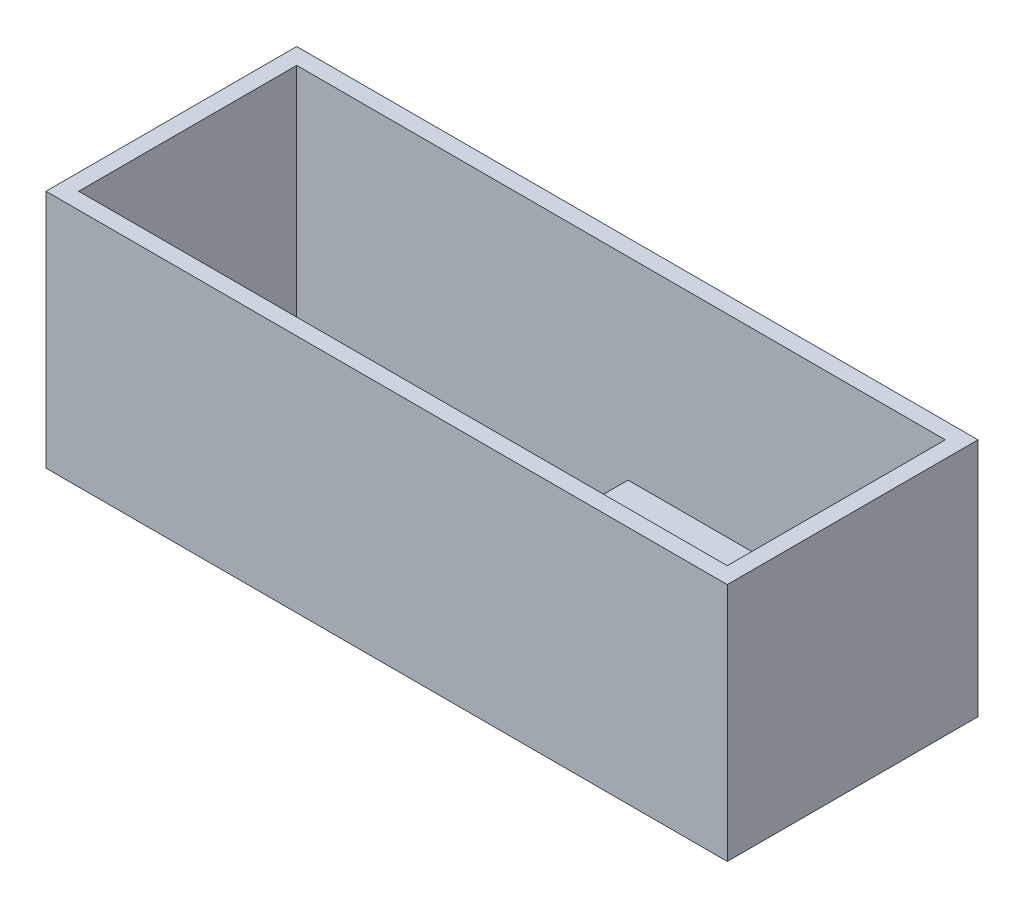
ISO-10303-21;
HEADER;
FILE_DESCRIPTION(('STEP AP214'),'2;1');
FILE_NAME('part.step','',(''),(''),'','','');
FILE_SCHEMA(('AUTOMOTIVE_DESIGN { 1 0 10303 214 1 1 1 1 }'));
ENDSEC;
DATA;
#1=APPLICATION_CONTEXT('core data for automotive mechanical design processes');
#2=APPLICATION_PROTOCOL_DEFINITION('international standard','automotive_design',2000,#1);
#3=PRODUCT_CONTEXT('',#1,'mechanical');
#4=PRODUCT('Part','Part','',(#3));
#5=PRODUCT_RELATED_PRODUCT_CATEGORY('part','',(#4));
#6=PRODUCT_DEFINITION_FORMATION('','',#4);
#7=PRODUCT_DEFINITION_CONTEXT('part definition',#1,'design');
#8=PRODUCT_DEFINITION('design','',#6,#7);
#9=PRODUCT_DEFINITION_SHAPE('','',#8);
#10=(LENGTH_UNIT() NAMED_UNIT(*) SI_UNIT(.MILLI.,.METRE.));
#11=(NAMED_UNIT(*) PLANE_ANGLE_UNIT() SI_UNIT($,.RADIAN.));
#12=(NAMED_UNIT(*) SI_UNIT($,.STERADIAN.) SOLID_ANGLE_UNIT());
#13=UNCERTAINTY_MEASURE_WITH_UNIT(LENGTH_MEASURE(1.E-05),#10,'distance_accuracy_value','');
#14=(GEOMETRIC_REPRESENTATION_CONTEXT(3) GLOBAL_UNCERTAINTY_ASSIGNED_CONTEXT((#13)) GLOBAL_UNIT_ASSIGNED_CONTEXT((#10,
#11,#12)) REPRESENTATION_CONTEXT('',''));
#15=CARTESIAN_POINT('',(0.,0.,0.));
#16=DIRECTION('',(0.,0.,1.));
#17=DIRECTION('',(1.,0.,0.));
#18=AXIS2_PLACEMENT_3D('',#15,#16,#17);
#19=CARTESIAN_POINT('',(59.5,44.,20.));
#20=DIRECTION('',(0.,0.,-1.));
#21=DIRECTION('',(-1.,0.,0.));
#22=AXIS2_PLACEMENT_3D('',#19,#20,#21);
#23=PLANE('',#22);
#24=DIRECTION('',(1.,0.,0.));
#25=VECTOR('',#24,1.);
#26=CARTESIAN_POINT('',(1.29999999999998,8.5,20.));
#27=LINE('',#26,#25);
#28=CARTESIAN_POINT('',(1.29999999999998,8.5,20.));
#29=VERTEX_POINT('',#28);
#30=CARTESIAN_POINT('',(29.3,8.5,20.));
#31=VERTEX_POINT('',#30);
#32=EDGE_CURVE('E150',#29,#31,#27,.T.);
#33=ORIENTED_EDGE('',*,*,#32,.F.);
#34=DIRECTION('',(0.,-1.,0.));
#35=VECTOR('',#34,1.);
#36=CARTESIAN_POINT('',(1.29999999999998,7.,20.));
#37=LINE('',#36,#35);
#38=CARTESIAN_POINT('',(1.29999999999998,4.,20.));
#39=VERTEX_POINT('',#38);
#40=EDGE_CURVE('E59',#29,#39,#37,.T.);
#41=ORIENTED_EDGE('',*,*,#40,.T.);
#42=DIRECTION('',(1.,0.,0.));
#43=VECTOR('',#42,1.);
#44=CARTESIAN_POINT('',(-59.5,4.,20.));
#45=LINE('',#44,#43);
#46=CARTESIAN_POINT('',(-59.5,4.,20.));
#47=VERTEX_POINT('',#46);
#48=EDGE_CURVE('E11',#47,#39,#45,.T.);
#49=ORIENTED_EDGE('',*,*,#48,.F.);
#50=DIRECTION('',(0.,-1.,0.));
#51=VECTOR('',#50,1.);
#52=CARTESIAN_POINT('',(-59.5,44.,20.));
#53=LINE('',#52,#51);
#54=CARTESIAN_POINT('',(-59.5,44.,20.));
#55=VERTEX_POINT('',#54);
#56=EDGE_CURVE('E180',#55,#47,#53,.T.);
#57=ORIENTED_EDGE('',*,*,#56,.F.);
#58=DIRECTION('',(1.,0.,0.));
#59=VECTOR('',#58,1.);
#60=CARTESIAN_POINT('',(59.5,44.,20.));
#61=LINE('',#60,#59);
#62=CARTESIAN_POINT('',(59.5,44.,20.));
#63=VERTEX_POINT('',#62);
#64=EDGE_CURVE('E165',#55,#63,#61,.T.);
#65=ORIENTED_EDGE('',*,*,#64,.T.);
#66=DIRECTION('',(0.,-1.,0.));
#67=VECTOR('',#66,1.);
#68=CARTESIAN_POINT('',(59.5,44.,20.));
#69=LINE('',#68,#67);
#70=CARTESIAN_POINT('',(59.5,7.,20.));
#71=VERTEX_POINT('',#70);
#72=EDGE_CURVE('E177',#63,#71,#69,.T.);
#73=ORIENTED_EDGE('',*,*,#72,.T.);
#74=DIRECTION('',(1.,0.,0.));
#75=VECTOR('',#74,1.);
#76=CARTESIAN_POINT('',(1.29999999999998,7.,20.));
#77=LINE('',#76,#75);
#78=CARTESIAN_POINT('',(29.3,7.,20.));
#79=VERTEX_POINT('',#78);
#80=EDGE_CURVE('E157',#79,#71,#77,.T.);
#81=ORIENTED_EDGE('',*,*,#80,.F.);
#82=DIRECTION('',(0.,-1.,0.));
#83=VECTOR('',#82,1.);
#84=CARTESIAN_POINT('',(29.3,8.5,20.));
#85=LINE('',#84,#83);
#86=EDGE_CURVE('E51',#31,#79,#85,.T.);
#87=ORIENTED_EDGE('',*,*,#86,.F.);
#88=EDGE_LOOP('',(#33,#41,#49,#57,#65,#73,#81,#87));
#89=FACE_BOUND('',#88,.T.);
#90=ADVANCED_FACE('F36',(#89),#23,.T.);
#91=CARTESIAN_POINT('',(59.5,44.,-20.));
#92=DIRECTION('',(0.,0.,1.));
#93=DIRECTION('',(1.,0.,0.));
#94=AXIS2_PLACEMENT_3D('',#91,#92,#93);
#95=PLANE('',#94);
#96=DIRECTION('',(0.,-1.,0.));
#97=VECTOR('',#96,1.);
#98=CARTESIAN_POINT('',(1.29999999999998,7.,-20.));
#99=LINE('',#98,#97);
#100=CARTESIAN_POINT('',(1.29999999999998,8.5,-20.));
#101=VERTEX_POINT('',#100);
#102=CARTESIAN_POINT('',(1.29999999999998,4.,-20.));
#103=VERTEX_POINT('',#102);
#104=EDGE_CURVE('E135',#101,#103,#99,.T.);
#105=ORIENTED_EDGE('',*,*,#104,.F.);
#106=DIRECTION('',(-1.,0.,0.));
#107=VECTOR('',#106,1.);
#108=CARTESIAN_POINT('',(1.29999999999998,8.5,-20.));
#109=LINE('',#108,#107);
#110=CARTESIAN_POINT('',(29.3,8.5,-20.));
#111=VERTEX_POINT('',#110);
#112=EDGE_CURVE('E141',#111,#101,#109,.T.);
#113=ORIENTED_EDGE('',*,*,#112,.F.);
#114=DIRECTION('',(0.,-1.,0.));
#115=VECTOR('',#114,1.);
#116=CARTESIAN_POINT('',(29.3,8.5,-20.));
#117=LINE('',#116,#115);
#118=CARTESIAN_POINT('',(29.3,7.,-20.));
#119=VERTEX_POINT('',#118);
#120=EDGE_CURVE('E138',#111,#119,#117,.T.);
#121=ORIENTED_EDGE('',*,*,#120,.T.);
#122=DIRECTION('',(-1.,0.,0.));
#123=VECTOR('',#122,1.);
#124=CARTESIAN_POINT('',(1.29999999999998,7.,-20.));
#125=LINE('',#124,#123);
#126=CARTESIAN_POINT('',(59.5,7.,-20.));
#127=VERTEX_POINT('',#126);
#128=EDGE_CURVE('E126',#127,#119,#125,.T.);
#129=ORIENTED_EDGE('',*,*,#128,.F.);
#130=DIRECTION('',(0.,-1.,0.));
#131=VECTOR('',#130,1.);
#132=CARTESIAN_POINT('',(59.5,44.,-20.));
#133=LINE('',#132,#131);
#134=CARTESIAN_POINT('',(59.5,44.,-20.));
#135=VERTEX_POINT('',#134);
#136=EDGE_CURVE('E175',#135,#127,#133,.T.);
#137=ORIENTED_EDGE('',*,*,#136,.F.);
#138=DIRECTION('',(-1.,0.,0.));
#139=VECTOR('',#138,1.);
#140=CARTESIAN_POINT('',(59.5,44.,-20.));
#141=LINE('',#140,#139);
#142=CARTESIAN_POINT('',(-59.5,44.,-20.));
#143=VERTEX_POINT('',#142);
#144=EDGE_CURVE('E170',#135,#143,#141,.T.);
#145=ORIENTED_EDGE('',*,*,#144,.T.);
#146=DIRECTION('',(0.,-1.,0.));
#147=VECTOR('',#146,1.);
#148=CARTESIAN_POINT('',(-59.5,44.,-20.));
#149=LINE('',#148,#147);
#150=CARTESIAN_POINT('',(-59.5,4.,-20.));
#151=VERTEX_POINT('',#150);
#152=EDGE_CURVE('E172',#143,#151,#149,.T.);
#153=ORIENTED_EDGE('',*,*,#152,.T.);
#154=DIRECTION('',(-1.,0.,0.));
#155=VECTOR('',#154,1.);
#156=CARTESIAN_POINT('',(-59.5,4.,-20.));
#157=LINE('',#156,#155);
#158=EDGE_CURVE('E213',#103,#151,#157,.T.);
#159=ORIENTED_EDGE('',*,*,#158,.F.);
#160=EDGE_LOOP('',(#105,#113,#121,#129,#137,#145,#153,#159));
#161=FACE_BOUND('',#160,.T.);
#162=ADVANCED_FACE('F139',(#161),#95,.T.);
#163=CARTESIAN_POINT('',(0.,7.,0.));
#164=DIRECTION('',(0.,-1.,0.));
#165=DIRECTION('',(0.,0.,-1.));
#166=AXIS2_PLACEMENT_3D('',#163,#164,#165);
#167=PLANE('',#166);
#168=DIRECTION('',(0.,0.,-1.));
#169=VECTOR('',#168,1.);
#170=CARTESIAN_POINT('',(29.3,7.,-20.));
#171=LINE('',#170,#169);
#172=EDGE_CURVE('E130',#79,#119,#171,.T.);
#173=ORIENTED_EDGE('',*,*,#172,.F.);
#174=ORIENTED_EDGE('',*,*,#80,.T.);
#175=DIRECTION('',(0.,0.,-1.));
#176=VECTOR('',#175,1.);
#177=CARTESIAN_POINT('',(59.5,7.,20.));
#178=LINE('',#177,#176);
#179=EDGE_CURVE('E132',#71,#127,#178,.T.);
#180=ORIENTED_EDGE('',*,*,#179,.T.);
#181=ORIENTED_EDGE('',*,*,#128,.T.);
#182=EDGE_LOOP('',(#173,#174,#180,#181));
#183=FACE_BOUND('',#182,.T.);
#184=ADVANCED_FACE('F128',(#183),#167,.F.);
#185=CARTESIAN_POINT('',(0.,4.,0.));
#186=DIRECTION('',(0.,-1.,0.));
#187=DIRECTION('',(0.,0.,-1.));
#188=AXIS2_PLACEMENT_3D('',#185,#186,#187);
#189=PLANE('',#188);
#190=DIRECTION('',(0.,0.,1.));
#191=VECTOR('',#190,1.);
#192=CARTESIAN_POINT('',(1.29999999999998,4.,20.));
#193=LINE('',#192,#191);
#194=EDGE_CURVE('E156',#103,#39,#193,.T.);
#195=ORIENTED_EDGE('',*,*,#194,.F.);
#196=ORIENTED_EDGE('',*,*,#158,.T.);
#197=DIRECTION('',(0.,0.,1.));
#198=VECTOR('',#197,1.);
#199=CARTESIAN_POINT('',(-59.5,4.,20.));
#200=LINE('',#199,#198);
#201=EDGE_CURVE('E44',#151,#47,#200,.T.);
#202=ORIENTED_EDGE('',*,*,#201,.T.);
#203=ORIENTED_EDGE('',*,*,#48,.T.);
#204=EDGE_LOOP('',(#195,#196,#202,#203));
#205=FACE_BOUND('',#204,.T.);
#206=ADVANCED_FACE('F218',(#205),#189,.F.);
#207=CARTESIAN_POINT('',(59.5,44.,20.));
#208=DIRECTION('',(-1.,0.,0.));
#209=DIRECTION('',(0.,0.,1.));
#210=AXIS2_PLACEMENT_3D('',#207,#208,#209);
#211=PLANE('',#210);
#212=ORIENTED_EDGE('',*,*,#136,.T.);
#213=ORIENTED_EDGE('',*,*,#179,.F.);
#214=ORIENTED_EDGE('',*,*,#72,.F.);
#215=DIRECTION('',(0.,0.,-1.));
#216=VECTOR('',#215,1.);
#217=CARTESIAN_POINT('',(59.5,44.,20.));
#218=LINE('',#217,#216);
#219=EDGE_CURVE('E167',#63,#135,#218,.T.);
#220=ORIENTED_EDGE('',*,*,#219,.T.);
#221=EDGE_LOOP('',(#212,#213,#214,#220));
#222=FACE_BOUND('',#221,.T.);
#223=ADVANCED_FACE('F232',(#222),#211,.T.);
#224=CARTESIAN_POINT('',(-59.5,44.,20.));
#225=DIRECTION('',(1.,0.,0.));
#226=DIRECTION('',(0.,0.,-1.));
#227=AXIS2_PLACEMENT_3D('',#224,#225,#226);
#228=PLANE('',#227);
#229=ORIENTED_EDGE('',*,*,#201,.F.);
#230=ORIENTED_EDGE('',*,*,#152,.F.);
#231=DIRECTION('',(0.,0.,1.));
#232=VECTOR('',#231,1.);
#233=CARTESIAN_POINT('',(-59.5,44.,20.));
#234=LINE('',#233,#232);
#235=EDGE_CURVE('E163',#143,#55,#234,.T.);
#236=ORIENTED_EDGE('',*,*,#235,.T.);
#237=ORIENTED_EDGE('',*,*,#56,.T.);
#238=EDGE_LOOP('',(#229,#230,#236,#237));
#239=FACE_BOUND('',#238,.T.);
#240=ADVANCED_FACE('F222',(#239),#228,.T.);
#241=CARTESIAN_POINT('',(0.,44.,0.));
#242=DIRECTION('',(0.,-1.,0.));
#243=DIRECTION('',(0.,0.,-1.));
#244=AXIS2_PLACEMENT_3D('',#241,#242,#243);
#245=PLANE('',#244);
#246=DIRECTION('',(0.,0.,-1.));
#247=VECTOR('',#246,1.);
#248=CARTESIAN_POINT('',(62.5,44.,23.));
#249=LINE('',#248,#247);
#250=CARTESIAN_POINT('',(62.5,44.,23.));
#251=VERTEX_POINT('',#250);
#252=CARTESIAN_POINT('',(62.5,44.,-23.));
#253=VERTEX_POINT('',#252);
#254=EDGE_CURVE('E184',#251,#253,#249,.T.);
#255=ORIENTED_EDGE('',*,*,#254,.T.);
#256=DIRECTION('',(-1.,0.,0.));
#257=VECTOR('',#256,1.);
#258=CARTESIAN_POINT('',(-62.5,44.,-23.));
#259=LINE('',#258,#257);
#260=CARTESIAN_POINT('',(-62.5,44.,-23.));
#261=VERTEX_POINT('',#260);
#262=EDGE_CURVE('E187',#253,#261,#259,.T.);
#263=ORIENTED_EDGE('',*,*,#262,.T.);
#264=DIRECTION('',(0.,0.,1.));
#265=VECTOR('',#264,1.);
#266=CARTESIAN_POINT('',(-62.5,44.,23.));
#267=LINE('',#266,#265);
#268=CARTESIAN_POINT('',(-62.5,44.,23.));
#269=VERTEX_POINT('',#268);
#270=EDGE_CURVE('E190',#261,#269,#267,.T.);
#271=ORIENTED_EDGE('',*,*,#270,.T.);
#272=DIRECTION('',(1.,0.,0.));
#273=VECTOR('',#272,1.);
#274=CARTESIAN_POINT('',(-62.5,44.,23.));
#275=LINE('',#274,#273);
#276=EDGE_CURVE('E192',#269,#251,#275,.T.);
#277=ORIENTED_EDGE('',*,*,#276,.T.);
#278=EDGE_LOOP('',(#255,#263,#271,#277));
#279=FACE_BOUND('',#278,.T.);
#280=ORIENTED_EDGE('',*,*,#235,.F.);
#281=ORIENTED_EDGE('',*,*,#144,.F.);
#282=ORIENTED_EDGE('',*,*,#219,.F.);
#283=ORIENTED_EDGE('',*,*,#64,.F.);
#284=EDGE_LOOP('',(#280,#281,#282,#283));
#285=FACE_BOUND('',#284,.T.);
#286=ADVANCED_FACE('F229',(#279,#285),#245,.F.);
#287=CARTESIAN_POINT('',(62.5,44.,23.));
#288=DIRECTION('',(-1.,0.,0.));
#289=DIRECTION('',(0.,0.,1.));
#290=AXIS2_PLACEMENT_3D('',#287,#288,#289);
#291=PLANE('',#290);
#292=DIRECTION('',(0.,0.,-1.));
#293=VECTOR('',#292,1.);
#294=CARTESIAN_POINT('',(62.5,0.,23.));
#295=LINE('',#294,#293);
#296=CARTESIAN_POINT('',(62.5,0.,23.));
#297=VERTEX_POINT('',#296);
#298=CARTESIAN_POINT('',(62.5,0.,-23.));
#299=VERTEX_POINT('',#298);
#300=EDGE_CURVE('E183',#297,#299,#295,.T.);
#301=ORIENTED_EDGE('',*,*,#300,.T.);
#302=DIRECTION('',(0.,-1.,0.));
#303=VECTOR('',#302,1.);
#304=CARTESIAN_POINT('',(62.5,44.,-23.));
#305=LINE('',#304,#303);
#306=EDGE_CURVE('E210',#253,#299,#305,.T.);
#307=ORIENTED_EDGE('',*,*,#306,.F.);
#308=ORIENTED_EDGE('',*,*,#254,.F.);
#309=DIRECTION('',(0.,-1.,0.));
#310=VECTOR('',#309,1.);
#311=CARTESIAN_POINT('',(62.5,44.,23.));
#312=LINE('',#311,#310);
#313=EDGE_CURVE('E194',#251,#297,#312,.T.);
#314=ORIENTED_EDGE('',*,*,#313,.T.);
#315=EDGE_LOOP('',(#301,#307,#308,#314));
#316=FACE_BOUND('',#315,.T.);
#317=ADVANCED_FACE('F259',(#316),#291,.F.);
#318=CARTESIAN_POINT('',(-62.5,44.,-23.));
#319=DIRECTION('',(0.,0.,1.));
#320=DIRECTION('',(1.,0.,0.));
#321=AXIS2_PLACEMENT_3D('',#318,#319,#320);
#322=PLANE('',#321);
#323=DIRECTION('',(-1.,0.,0.));
#324=VECTOR('',#323,1.);
#325=CARTESIAN_POINT('',(-62.5,0.,-23.));
#326=LINE('',#325,#324);
#327=CARTESIAN_POINT('',(-62.5,0.,-23.));
#328=VERTEX_POINT('',#327);
#329=EDGE_CURVE('E197',#299,#328,#326,.T.);
#330=ORIENTED_EDGE('',*,*,#329,.T.);
#331=DIRECTION('',(0.,-1.,0.));
#332=VECTOR('',#331,1.);
#333=CARTESIAN_POINT('',(-62.5,44.,-23.));
#334=LINE('',#333,#332);
#335=EDGE_CURVE('E207',#261,#328,#334,.T.);
#336=ORIENTED_EDGE('',*,*,#335,.F.);
#337=ORIENTED_EDGE('',*,*,#262,.F.);
#338=ORIENTED_EDGE('',*,*,#306,.T.);
#339=EDGE_LOOP('',(#330,#336,#337,#338));
#340=FACE_BOUND('',#339,.T.);
#341=ADVANCED_FACE('F267',(#340),#322,.F.);
#342=CARTESIAN_POINT('',(-62.5,44.,23.));
#343=DIRECTION('',(1.,0.,0.));
#344=DIRECTION('',(0.,0.,-1.));
#345=AXIS2_PLACEMENT_3D('',#342,#343,#344);
#346=PLANE('',#345);
#347=DIRECTION('',(0.,0.,1.));
#348=VECTOR('',#347,1.);
#349=CARTESIAN_POINT('',(-62.5,0.,23.));
#350=LINE('',#349,#348);
#351=CARTESIAN_POINT('',(-62.5,0.,23.));
#352=VERTEX_POINT('',#351);
#353=EDGE_CURVE('E199',#328,#352,#350,.T.);
#354=ORIENTED_EDGE('',*,*,#353,.T.);
#355=DIRECTION('',(0.,-1.,0.));
#356=VECTOR('',#355,1.);
#357=CARTESIAN_POINT('',(-62.5,44.,23.));
#358=LINE('',#357,#356);
#359=EDGE_CURVE('E204',#269,#352,#358,.T.);
#360=ORIENTED_EDGE('',*,*,#359,.F.);
#361=ORIENTED_EDGE('',*,*,#270,.F.);
#362=ORIENTED_EDGE('',*,*,#335,.T.);
#363=EDGE_LOOP('',(#354,#360,#361,#362));
#364=FACE_BOUND('',#363,.T.);
#365=ADVANCED_FACE('F263',(#364),#346,.F.);
#366=CARTESIAN_POINT('',(-62.5,44.,23.));
#367=DIRECTION('',(0.,0.,-1.));
#368=DIRECTION('',(-1.,0.,0.));
#369=AXIS2_PLACEMENT_3D('',#366,#367,#368);
#370=PLANE('',#369);
#371=DIRECTION('',(1.,0.,0.));
#372=VECTOR('',#371,1.);
#373=CARTESIAN_POINT('',(-62.5,0.,23.));
#374=LINE('',#373,#372);
#375=EDGE_CURVE('E188',#352,#297,#374,.T.);
#376=ORIENTED_EDGE('',*,*,#375,.T.);
#377=ORIENTED_EDGE('',*,*,#313,.F.);
#378=ORIENTED_EDGE('',*,*,#276,.F.);
#379=ORIENTED_EDGE('',*,*,#359,.T.);
#380=EDGE_LOOP('',(#376,#377,#378,#379));
#381=FACE_BOUND('',#380,.T.);
#382=ADVANCED_FACE('F244',(#381),#370,.F.);
#383=CARTESIAN_POINT('',(0.,0.,0.));
#384=DIRECTION('',(0.,-1.,0.));
#385=DIRECTION('',(0.,0.,-1.));
#386=AXIS2_PLACEMENT_3D('',#383,#384,#385);
#387=PLANE('',#386);
#388=ORIENTED_EDGE('',*,*,#300,.F.);
#389=ORIENTED_EDGE('',*,*,#375,.F.);
#390=ORIENTED_EDGE('',*,*,#353,.F.);
#391=ORIENTED_EDGE('',*,*,#329,.F.);
#392=EDGE_LOOP('',(#388,#389,#390,#391));
#393=FACE_BOUND('',#392,.T.);
#394=ADVANCED_FACE('F38',(#393),#387,.T.);
#395=CARTESIAN_POINT('',(1.29999999999998,7.,20.));
#396=DIRECTION('',(1.,0.,0.));
#397=DIRECTION('',(0.,0.,-1.));
#398=AXIS2_PLACEMENT_3D('',#395,#396,#397);
#399=PLANE('',#398);
#400=ORIENTED_EDGE('',*,*,#194,.T.);
#401=ORIENTED_EDGE('',*,*,#40,.F.);
#402=DIRECTION('',(0.,0.,1.));
#403=VECTOR('',#402,1.);
#404=CARTESIAN_POINT('',(1.29999999999998,8.5,-20.));
#405=LINE('',#404,#403);
#406=EDGE_CURVE('E147',#101,#29,#405,.T.);
#407=ORIENTED_EDGE('',*,*,#406,.F.);
#408=ORIENTED_EDGE('',*,*,#104,.T.);
#409=EDGE_LOOP('',(#400,#401,#407,#408));
#410=FACE_BOUND('',#409,.T.);
#411=ADVANCED_FACE('F236',(#410),#399,.F.);
#412=CARTESIAN_POINT('',(29.3,8.5,-20.));
#413=DIRECTION('',(-1.,0.,0.));
#414=DIRECTION('',(0.,0.,1.));
#415=AXIS2_PLACEMENT_3D('',#412,#413,#414);
#416=PLANE('',#415);
#417=ORIENTED_EDGE('',*,*,#172,.T.);
#418=ORIENTED_EDGE('',*,*,#120,.F.);
#419=DIRECTION('',(0.,0.,-1.));
#420=VECTOR('',#419,1.);
#421=CARTESIAN_POINT('',(29.3,8.5,-20.));
#422=LINE('',#421,#420);
#423=EDGE_CURVE('E235',#31,#111,#422,.T.);
#424=ORIENTED_EDGE('',*,*,#423,.F.);
#425=ORIENTED_EDGE('',*,*,#86,.T.);
#426=EDGE_LOOP('',(#417,#418,#424,#425));
#427=FACE_BOUND('',#426,.T.);
#428=ADVANCED_FACE('F146',(#427),#416,.F.);
#429=CARTESIAN_POINT('',(0.,8.5,0.));
#430=DIRECTION('',(0.,1.,0.));
#431=DIRECTION('',(0.,0.,1.));
#432=AXIS2_PLACEMENT_3D('',#429,#430,#431);
#433=PLANE('',#432);
#434=ORIENTED_EDGE('',*,*,#406,.T.);
#435=ORIENTED_EDGE('',*,*,#32,.T.);
#436=ORIENTED_EDGE('',*,*,#423,.T.);
#437=ORIENTED_EDGE('',*,*,#112,.T.);
#438=EDGE_LOOP('',(#434,#435,#436,#437));
#439=FACE_BOUND('',#438,.T.);
#440=ADVANCED_FACE('F234',(#439),#433,.T.);
#441=CLOSED_SHELL('',(#90,#162,#184,#206,#223,#240,#286,#317,#341,#365,#382,#394,#411,#428,#440));
#442=MANIFOLD_SOLID_BREP('B2',#441);
#443=ADVANCED_BREP_SHAPE_REPRESENTATION('',(#18,#442),#14);
#444=SHAPE_DEFINITION_REPRESENTATION(#9,#443);
ENDSEC;
END-ISO-10303-21;
